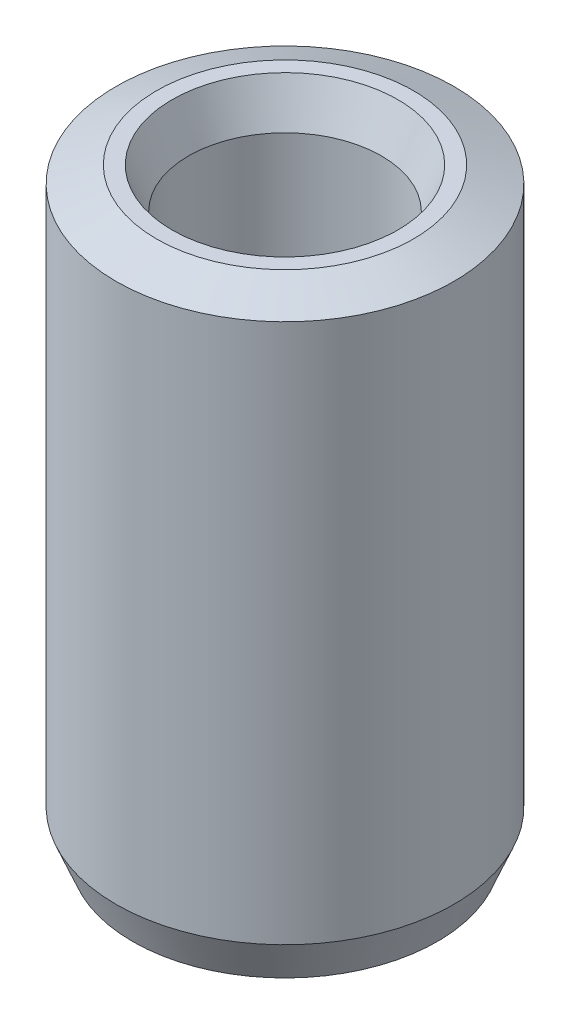
ISO-10303-21;
HEADER;
FILE_DESCRIPTION(('STEP AP214'),'2;1');
FILE_NAME('part.step','',(''),(''),'','','');
FILE_SCHEMA(('AUTOMOTIVE_DESIGN { 1 0 10303 214 1 1 1 1 }'));
ENDSEC;
DATA;
#1=APPLICATION_CONTEXT('core data for automotive mechanical design processes');
#2=APPLICATION_PROTOCOL_DEFINITION('international standard','automotive_design',2000,#1);
#3=PRODUCT_CONTEXT('',#1,'mechanical');
#4=PRODUCT('Part','Part','',(#3));
#5=PRODUCT_RELATED_PRODUCT_CATEGORY('part','',(#4));
#6=PRODUCT_DEFINITION_FORMATION('','',#4);
#7=PRODUCT_DEFINITION_CONTEXT('part definition',#1,'design');
#8=PRODUCT_DEFINITION('design','',#6,#7);
#9=PRODUCT_DEFINITION_SHAPE('','',#8);
#10=(LENGTH_UNIT() NAMED_UNIT(*) SI_UNIT(.MILLI.,.METRE.));
#11=(NAMED_UNIT(*) PLANE_ANGLE_UNIT() SI_UNIT($,.RADIAN.));
#12=(NAMED_UNIT(*) SI_UNIT($,.STERADIAN.) SOLID_ANGLE_UNIT());
#13=UNCERTAINTY_MEASURE_WITH_UNIT(LENGTH_MEASURE(1.E-05),#10,'distance_accuracy_value','');
#14=(GEOMETRIC_REPRESENTATION_CONTEXT(3) GLOBAL_UNCERTAINTY_ASSIGNED_CONTEXT((#13)) GLOBAL_UNIT_ASSIGNED_CONTEXT((#10,
#11,#12)) REPRESENTATION_CONTEXT('',''));
#15=CARTESIAN_POINT('',(0.,0.,0.));
#16=DIRECTION('',(0.,0.,1.));
#17=DIRECTION('',(1.,0.,0.));
#18=AXIS2_PLACEMENT_3D('',#15,#16,#17);
#19=CARTESIAN_POINT('',(0.,52.9691252099814,0.));
#20=DIRECTION('',(0.,-1.,0.));
#21=DIRECTION('',(0.,0.,-1.));
#22=AXIS2_PLACEMENT_3D('',#19,#20,#21);
#23=CYLINDRICAL_SURFACE('',#22,15.);
#24=CARTESIAN_POINT('',(0.,3.59114397658788,0.));
#25=DIRECTION('',(0.,1.,0.));
#26=DIRECTION('',(0.,0.,1.));
#27=AXIS2_PLACEMENT_3D('',#24,#25,#26);
#28=CIRCLE('',#27,15.);
#29=CARTESIAN_POINT('',(0.,3.59114397658788,15.));
#30=VERTEX_POINT('',#29);
#31=EDGE_CURVE('E10',#30,#30,#28,.T.);
#32=ORIENTED_EDGE('',*,*,#31,.T.);
#33=EDGE_LOOP('',(#32));
#34=FACE_BOUND('',#33,.T.);
#35=CARTESIAN_POINT('',(0.,51.5026297404642,0.));
#36=DIRECTION('',(0.,1.,0.));
#37=DIRECTION('',(0.,0.,1.));
#38=AXIS2_PLACEMENT_3D('',#35,#36,#37);
#39=CIRCLE('',#38,15.);
#40=CARTESIAN_POINT('',(0.,51.5026297404642,15.));
#41=VERTEX_POINT('',#40);
#42=EDGE_CURVE('E50',#41,#41,#39,.F.);
#43=ORIENTED_EDGE('',*,*,#42,.T.);
#44=EDGE_LOOP('',(#43));
#45=FACE_BOUND('',#44,.T.);
#46=ADVANCED_FACE('F39',(#34,#45),#23,.T.);
#47=CARTESIAN_POINT('',(0.,52.9691252099814,0.));
#48=DIRECTION('',(0.,1.,0.));
#49=DIRECTION('',(0.,0.,1.));
#50=AXIS2_PLACEMENT_3D('',#47,#48,#49);
#51=PLANE('',#50);
#52=CARTESIAN_POINT('',(0.,52.9691252099814,0.));
#53=DIRECTION('',(0.,1.,0.));
#54=DIRECTION('',(0.,0.,1.));
#55=AXIS2_PLACEMENT_3D('',#52,#53,#54);
#56=CIRCLE('',#55,10.0286574890297);
#57=CARTESIAN_POINT('',(0.,52.9691252099814,10.0286574890297));
#58=VERTEX_POINT('',#57);
#59=EDGE_CURVE('E58',#58,#58,#56,.F.);
#60=ORIENTED_EDGE('',*,*,#59,.T.);
#61=EDGE_LOOP('',(#60));
#62=FACE_BOUND('',#61,.T.);
#63=CARTESIAN_POINT('',(0.,52.9691252099814,0.));
#64=DIRECTION('',(0.,1.,0.));
#65=DIRECTION('',(0.,0.,1.));
#66=AXIS2_PLACEMENT_3D('',#63,#64,#65);
#67=CIRCLE('',#66,11.4088560234121);
#68=CARTESIAN_POINT('',(0.,52.9691252099814,11.4088560234121));
#69=VERTEX_POINT('',#68);
#70=EDGE_CURVE('E61',#69,#69,#67,.T.);
#71=ORIENTED_EDGE('',*,*,#70,.T.);
#72=EDGE_LOOP('',(#71));
#73=FACE_BOUND('',#72,.T.);
#74=ADVANCED_FACE('F88',(#62,#73),#51,.T.);
#75=CARTESIAN_POINT('',(0.,0.,0.));
#76=DIRECTION('',(0.,1.,0.));
#77=DIRECTION('',(0.,0.,1.));
#78=AXIS2_PLACEMENT_3D('',#75,#76,#77);
#79=PLANE('',#78);
#80=CARTESIAN_POINT('',(0.,0.,0.));
#81=DIRECTION('',(0.,1.,0.));
#82=DIRECTION('',(0.,0.,1.));
#83=AXIS2_PLACEMENT_3D('',#80,#81,#82);
#84=CIRCLE('',#83,12.1533059961003);
#85=CARTESIAN_POINT('',(0.,0.,12.1533059961003));
#86=VERTEX_POINT('',#85);
#87=EDGE_CURVE('E51',#86,#86,#84,.T.);
#88=ORIENTED_EDGE('',*,*,#87,.T.);
#89=EDGE_LOOP('',(#88));
#90=FACE_BOUND('',#89,.T.);
#91=CARTESIAN_POINT('',(0.,0.,0.));
#92=DIRECTION('',(0.,1.,0.));
#93=DIRECTION('',(0.,0.,1.));
#94=AXIS2_PLACEMENT_3D('',#91,#92,#93);
#95=CIRCLE('',#94,13.5335045304828);
#96=CARTESIAN_POINT('',(0.,0.,13.5335045304828));
#97=VERTEX_POINT('',#96);
#98=EDGE_CURVE('E54',#97,#97,#95,.F.);
#99=ORIENTED_EDGE('',*,*,#98,.T.);
#100=EDGE_LOOP('',(#99));
#101=FACE_BOUND('',#100,.T.);
#102=ADVANCED_FACE('F83',(#90,#101),#79,.F.);
#103=CARTESIAN_POINT('',(0.,52.9691252099814,0.));
#104=DIRECTION('',(0.,-1.,0.));
#105=DIRECTION('',(0.,0.,-1.));
#106=AXIS2_PLACEMENT_3D('',#103,#104,#105);
#107=CYLINDRICAL_SURFACE('',#106,8.56216201951242);
#108=CARTESIAN_POINT('',(0.,49.3779812333935,0.));
#109=DIRECTION('',(0.,1.,0.));
#110=DIRECTION('',(0.,0.,1.));
#111=AXIS2_PLACEMENT_3D('',#108,#109,#110);
#112=CIRCLE('',#111,8.56216201951242);
#113=CARTESIAN_POINT('',(0.,49.3779812333935,8.56216201951242));
#114=VERTEX_POINT('',#113);
#115=EDGE_CURVE('E67',#114,#114,#112,.T.);
#116=ORIENTED_EDGE('',*,*,#115,.T.);
#117=EDGE_LOOP('',(#116));
#118=FACE_BOUND('',#117,.T.);
#119=CARTESIAN_POINT('',(0.,1.46649546951724,0.));
#120=DIRECTION('',(0.,1.,0.));
#121=DIRECTION('',(0.,0.,1.));
#122=AXIS2_PLACEMENT_3D('',#119,#120,#121);
#123=CIRCLE('',#122,8.56216201951242);
#124=CARTESIAN_POINT('',(0.,1.46649546951724,8.56216201951242));
#125=VERTEX_POINT('',#124);
#126=EDGE_CURVE('E69',#125,#125,#123,.F.);
#127=ORIENTED_EDGE('',*,*,#126,.T.);
#128=EDGE_LOOP('',(#127));
#129=FACE_BOUND('',#128,.T.);
#130=ADVANCED_FACE('F71',(#118,#129),#107,.F.);
#131=CARTESIAN_POINT('',(0.,49.3779812333935,0.));
#132=DIRECTION('',(0.,1.,0.));
#133=DIRECTION('',(0.,0.,1.));
#134=AXIS2_PLACEMENT_3D('',#131,#132,#133);
#135=CONICAL_SURFACE('',#134,8.56216201951242,0.387696232327321);
#136=ORIENTED_EDGE('',*,*,#59,.F.);
#137=EDGE_LOOP('',(#136));
#138=FACE_BOUND('',#137,.T.);
#139=ORIENTED_EDGE('',*,*,#115,.F.);
#140=EDGE_LOOP('',(#139));
#141=FACE_BOUND('',#140,.T.);
#142=ADVANCED_FACE('F77',(#138,#141),#135,.F.);
#143=CARTESIAN_POINT('',(0.,0.,0.));
#144=DIRECTION('',(0.,-1.,0.));
#145=DIRECTION('',(0.,0.,-1.));
#146=AXIS2_PLACEMENT_3D('',#143,#144,#145);
#147=CONICAL_SURFACE('',#146,12.1533059961003,1.18310009446758);
#148=ORIENTED_EDGE('',*,*,#126,.F.);
#149=EDGE_LOOP('',(#148));
#150=FACE_BOUND('',#149,.T.);
#151=ORIENTED_EDGE('',*,*,#87,.F.);
#152=EDGE_LOOP('',(#151));
#153=FACE_BOUND('',#152,.T.);
#154=ADVANCED_FACE('F73',(#150,#153),#147,.F.);
#155=CARTESIAN_POINT('',(0.,3.59114397658788,0.));
#156=DIRECTION('',(0.,1.,0.));
#157=DIRECTION('',(0.,0.,1.));
#158=AXIS2_PLACEMENT_3D('',#155,#156,#157);
#159=CONICAL_SURFACE('',#158,15.,0.387696232327321);
#160=ORIENTED_EDGE('',*,*,#98,.F.);
#161=EDGE_LOOP('',(#160));
#162=FACE_BOUND('',#161,.T.);
#163=ORIENTED_EDGE('',*,*,#31,.F.);
#164=EDGE_LOOP('',(#163));
#165=FACE_BOUND('',#164,.T.);
#166=ADVANCED_FACE('F76',(#162,#165),#159,.T.);
#167=CARTESIAN_POINT('',(0.,52.9691252099814,0.));
#168=DIRECTION('',(0.,-1.,0.));
#169=DIRECTION('',(0.,0.,-1.));
#170=AXIS2_PLACEMENT_3D('',#167,#168,#169);
#171=CONICAL_SURFACE('',#170,11.4088560234121,1.18310009446758);
#172=ORIENTED_EDGE('',*,*,#42,.F.);
#173=EDGE_LOOP('',(#172));
#174=FACE_BOUND('',#173,.T.);
#175=ORIENTED_EDGE('',*,*,#70,.F.);
#176=EDGE_LOOP('',(#175));
#177=FACE_BOUND('',#176,.T.);
#178=ADVANCED_FACE('F45',(#174,#177),#171,.T.);
#179=CLOSED_SHELL('',(#46,#74,#102,#130,#142,#154,#166,#178));
#180=MANIFOLD_SOLID_BREP('B2',#179);
#181=ADVANCED_BREP_SHAPE_REPRESENTATION('',(#18,#180),#14);
#182=SHAPE_DEFINITION_REPRESENTATION(#9,#181);
ENDSEC;
END-ISO-10303-21;
